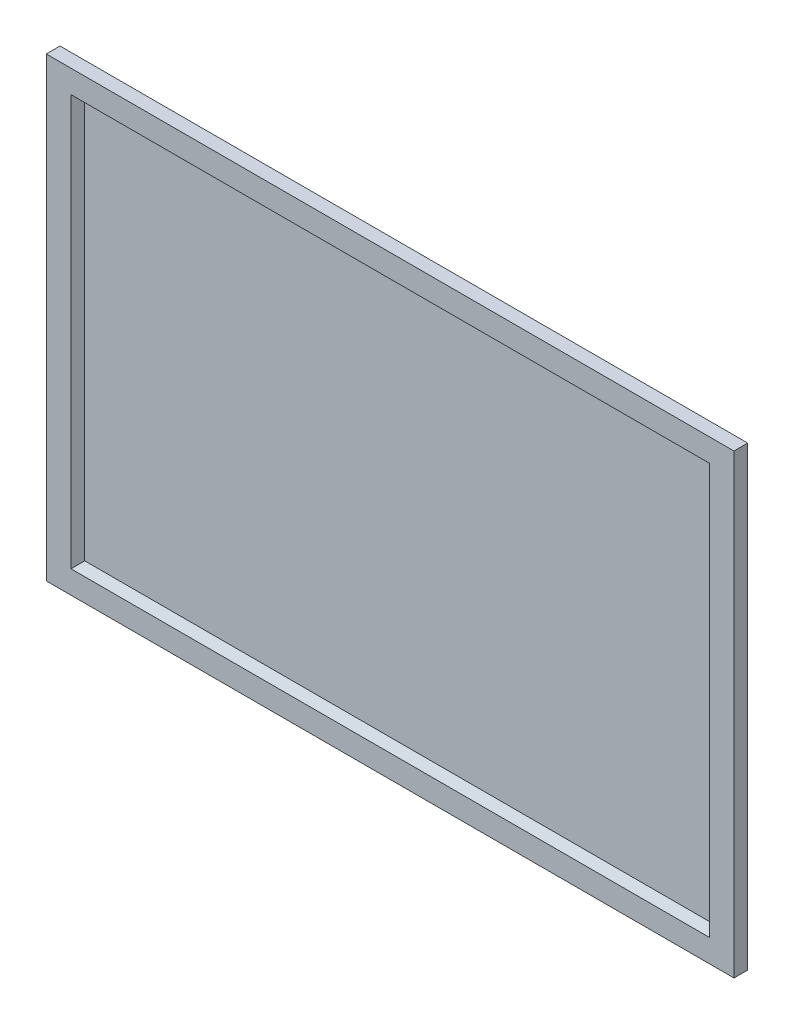
ISO-10303-21;
HEADER;
FILE_DESCRIPTION(('STEP AP214'),'2;1');
FILE_NAME('part.step','',(''),(''),'','','');
FILE_SCHEMA(('AUTOMOTIVE_DESIGN { 1 0 10303 214 1 1 1 1 }'));
ENDSEC;
DATA;
#1=APPLICATION_CONTEXT('core data for automotive mechanical design processes');
#2=APPLICATION_PROTOCOL_DEFINITION('international standard','automotive_design',2000,#1);
#3=PRODUCT_CONTEXT('',#1,'mechanical');
#4=PRODUCT('Part','Part','',(#3));
#5=PRODUCT_RELATED_PRODUCT_CATEGORY('part','',(#4));
#6=PRODUCT_DEFINITION_FORMATION('','',#4);
#7=PRODUCT_DEFINITION_CONTEXT('part definition',#1,'design');
#8=PRODUCT_DEFINITION('design','',#6,#7);
#9=PRODUCT_DEFINITION_SHAPE('','',#8);
#10=(LENGTH_UNIT() NAMED_UNIT(*) SI_UNIT(.MILLI.,.METRE.));
#11=(NAMED_UNIT(*) PLANE_ANGLE_UNIT() SI_UNIT($,.RADIAN.));
#12=(NAMED_UNIT(*) SI_UNIT($,.STERADIAN.) SOLID_ANGLE_UNIT());
#13=UNCERTAINTY_MEASURE_WITH_UNIT(LENGTH_MEASURE(1.E-05),#10,'distance_accuracy_value','');
#14=(GEOMETRIC_REPRESENTATION_CONTEXT(3) GLOBAL_UNCERTAINTY_ASSIGNED_CONTEXT((#13)) GLOBAL_UNIT_ASSIGNED_CONTEXT((#10,
#11,#12)) REPRESENTATION_CONTEXT('',''));
#15=CARTESIAN_POINT('',(0.,0.,0.));
#16=DIRECTION('',(0.,0.,1.));
#17=DIRECTION('',(1.,0.,0.));
#18=AXIS2_PLACEMENT_3D('',#15,#16,#17);
#19=CARTESIAN_POINT('',(500.,-331.818181818182,20.));
#20=DIRECTION('',(-1.,0.,0.));
#21=DIRECTION('',(0.,0.,1.));
#22=AXIS2_PLACEMENT_3D('',#19,#20,#21);
#23=PLANE('',#22);
#24=DIRECTION('',(0.,1.,0.));
#25=VECTOR('',#24,1.);
#26=CARTESIAN_POINT('',(500.,-331.818181818182,0.));
#27=LINE('',#26,#25);
#28=CARTESIAN_POINT('',(500.,-331.818181818182,0.));
#29=VERTEX_POINT('',#28);
#30=CARTESIAN_POINT('',(500.,331.818181818182,0.));
#31=VERTEX_POINT('',#30);
#32=EDGE_CURVE('E120',#29,#31,#27,.T.);
#33=ORIENTED_EDGE('',*,*,#32,.T.);
#34=DIRECTION('',(0.,0.,-1.));
#35=VECTOR('',#34,1.);
#36=CARTESIAN_POINT('',(500.,331.818181818182,20.));
#37=LINE('',#36,#35);
#38=CARTESIAN_POINT('',(500.,331.818181818182,20.));
#39=VERTEX_POINT('',#38);
#40=EDGE_CURVE('E101',#39,#31,#37,.T.);
#41=ORIENTED_EDGE('',*,*,#40,.F.);
#42=DIRECTION('',(0.,1.,0.));
#43=VECTOR('',#42,1.);
#44=CARTESIAN_POINT('',(500.,-331.818181818182,20.));
#45=LINE('',#44,#43);
#46=CARTESIAN_POINT('',(500.,-331.818181818182,20.));
#47=VERTEX_POINT('',#46);
#48=EDGE_CURVE('E108',#47,#39,#45,.T.);
#49=ORIENTED_EDGE('',*,*,#48,.F.);
#50=DIRECTION('',(0.,0.,-1.));
#51=VECTOR('',#50,1.);
#52=CARTESIAN_POINT('',(500.,-331.818181818182,20.));
#53=LINE('',#52,#51);
#54=EDGE_CURVE('E160',#47,#29,#53,.T.);
#55=ORIENTED_EDGE('',*,*,#54,.T.);
#56=EDGE_LOOP('',(#33,#41,#49,#55));
#57=FACE_BOUND('',#56,.T.);
#58=ADVANCED_FACE('F33',(#57),#23,.F.);
#59=CARTESIAN_POINT('',(-500.,331.818181818182,20.));
#60=DIRECTION('',(0.,-1.,0.));
#61=DIRECTION('',(0.,0.,-1.));
#62=AXIS2_PLACEMENT_3D('',#59,#60,#61);
#63=PLANE('',#62);
#64=DIRECTION('',(-1.,0.,0.));
#65=VECTOR('',#64,1.);
#66=CARTESIAN_POINT('',(-500.,331.818181818182,0.));
#67=LINE('',#66,#65);
#68=CARTESIAN_POINT('',(-500.,331.818181818182,0.));
#69=VERTEX_POINT('',#68);
#70=EDGE_CURVE('E151',#31,#69,#67,.T.);
#71=ORIENTED_EDGE('',*,*,#70,.T.);
#72=DIRECTION('',(0.,0.,-1.));
#73=VECTOR('',#72,1.);
#74=CARTESIAN_POINT('',(-500.,331.818181818182,20.));
#75=LINE('',#74,#73);
#76=CARTESIAN_POINT('',(-500.,331.818181818182,20.));
#77=VERTEX_POINT('',#76);
#78=EDGE_CURVE('E104',#77,#69,#75,.T.);
#79=ORIENTED_EDGE('',*,*,#78,.F.);
#80=DIRECTION('',(-1.,0.,0.));
#81=VECTOR('',#80,1.);
#82=CARTESIAN_POINT('',(-500.,331.818181818182,20.));
#83=LINE('',#82,#81);
#84=EDGE_CURVE('E97',#39,#77,#83,.T.);
#85=ORIENTED_EDGE('',*,*,#84,.F.);
#86=ORIENTED_EDGE('',*,*,#40,.T.);
#87=EDGE_LOOP('',(#71,#79,#85,#86));
#88=FACE_BOUND('',#87,.T.);
#89=ADVANCED_FACE('F99',(#88),#63,.F.);
#90=CARTESIAN_POINT('',(-500.,-331.818181818182,20.));
#91=DIRECTION('',(1.,0.,0.));
#92=DIRECTION('',(0.,0.,-1.));
#93=AXIS2_PLACEMENT_3D('',#90,#91,#92);
#94=PLANE('',#93);
#95=DIRECTION('',(0.,-1.,0.));
#96=VECTOR('',#95,1.);
#97=CARTESIAN_POINT('',(-500.,-331.818181818182,0.));
#98=LINE('',#97,#96);
#99=CARTESIAN_POINT('',(-500.,-331.818181818182,0.));
#100=VERTEX_POINT('',#99);
#101=EDGE_CURVE('E153',#69,#100,#98,.T.);
#102=ORIENTED_EDGE('',*,*,#101,.T.);
#103=DIRECTION('',(0.,0.,-1.));
#104=VECTOR('',#103,1.);
#105=CARTESIAN_POINT('',(-500.,-331.818181818182,20.));
#106=LINE('',#105,#104);
#107=CARTESIAN_POINT('',(-500.,-331.818181818182,20.));
#108=VERTEX_POINT('',#107);
#109=EDGE_CURVE('E125',#108,#100,#106,.T.);
#110=ORIENTED_EDGE('',*,*,#109,.F.);
#111=DIRECTION('',(0.,-1.,0.));
#112=VECTOR('',#111,1.);
#113=CARTESIAN_POINT('',(-500.,-331.818181818182,20.));
#114=LINE('',#113,#112);
#115=EDGE_CURVE('E107',#77,#108,#114,.T.);
#116=ORIENTED_EDGE('',*,*,#115,.F.);
#117=ORIENTED_EDGE('',*,*,#78,.T.);
#118=EDGE_LOOP('',(#102,#110,#116,#117));
#119=FACE_BOUND('',#118,.T.);
#120=ADVANCED_FACE('F170',(#119),#94,.F.);
#121=CARTESIAN_POINT('',(-500.,-331.818181818182,20.));
#122=DIRECTION('',(0.,1.,0.));
#123=DIRECTION('',(0.,0.,1.));
#124=AXIS2_PLACEMENT_3D('',#121,#122,#123);
#125=PLANE('',#124);
#126=DIRECTION('',(1.,0.,0.));
#127=VECTOR('',#126,1.);
#128=CARTESIAN_POINT('',(-500.,-331.818181818182,0.));
#129=LINE('',#128,#127);
#130=EDGE_CURVE('E117',#100,#29,#129,.T.);
#131=ORIENTED_EDGE('',*,*,#130,.T.);
#132=ORIENTED_EDGE('',*,*,#54,.F.);
#133=DIRECTION('',(1.,0.,0.));
#134=VECTOR('',#133,1.);
#135=CARTESIAN_POINT('',(-500.,-331.818181818182,20.));
#136=LINE('',#135,#134);
#137=EDGE_CURVE('E113',#108,#47,#136,.T.);
#138=ORIENTED_EDGE('',*,*,#137,.F.);
#139=ORIENTED_EDGE('',*,*,#109,.T.);
#140=EDGE_LOOP('',(#131,#132,#138,#139));
#141=FACE_BOUND('',#140,.T.);
#142=ADVANCED_FACE('F165',(#141),#125,.F.);
#143=CARTESIAN_POINT('',(0.,0.,20.));
#144=DIRECTION('',(0.,0.,-1.));
#145=DIRECTION('',(-1.,0.,0.));
#146=AXIS2_PLACEMENT_3D('',#143,#144,#145);
#147=PLANE('',#146);
#148=DIRECTION('',(-1.,0.,0.));
#149=VECTOR('',#148,1.);
#150=CARTESIAN_POINT('',(0.,298.561717833127,20.));
#151=LINE('',#150,#149);
#152=CARTESIAN_POINT('',(-464.076094370604,298.561717833127,20.));
#153=VERTEX_POINT('',#152);
#154=CARTESIAN_POINT('',(464.076094370604,298.561717833127,20.));
#155=VERTEX_POINT('',#154);
#156=EDGE_CURVE('E42',#153,#155,#151,.F.);
#157=ORIENTED_EDGE('',*,*,#156,.T.);
#158=DIRECTION('',(0.,1.,0.));
#159=VECTOR('',#158,1.);
#160=CARTESIAN_POINT('',(464.076094370604,0.,20.));
#161=LINE('',#160,#159);
#162=CARTESIAN_POINT('',(464.076094370604,-298.561717833127,20.));
#163=VERTEX_POINT('',#162);
#164=EDGE_CURVE('E11',#155,#163,#161,.F.);
#165=ORIENTED_EDGE('',*,*,#164,.T.);
#166=DIRECTION('',(1.,0.,0.));
#167=VECTOR('',#166,1.);
#168=CARTESIAN_POINT('',(0.,-298.561717833127,20.));
#169=LINE('',#168,#167);
#170=CARTESIAN_POINT('',(-464.076094370604,-298.561717833127,20.));
#171=VERTEX_POINT('',#170);
#172=EDGE_CURVE('E135',#163,#171,#169,.F.);
#173=ORIENTED_EDGE('',*,*,#172,.T.);
#174=DIRECTION('',(0.,-1.,0.));
#175=VECTOR('',#174,1.);
#176=CARTESIAN_POINT('',(-464.076094370604,0.,20.));
#177=LINE('',#176,#175);
#178=EDGE_CURVE('E53',#171,#153,#177,.F.);
#179=ORIENTED_EDGE('',*,*,#178,.T.);
#180=EDGE_LOOP('',(#157,#165,#173,#179));
#181=FACE_BOUND('',#180,.T.);
#182=ORIENTED_EDGE('',*,*,#48,.T.);
#183=ORIENTED_EDGE('',*,*,#84,.T.);
#184=ORIENTED_EDGE('',*,*,#115,.T.);
#185=ORIENTED_EDGE('',*,*,#137,.T.);
#186=EDGE_LOOP('',(#182,#183,#184,#185));
#187=FACE_BOUND('',#186,.T.);
#188=ADVANCED_FACE('F111',(#181,#187),#147,.F.);
#189=CARTESIAN_POINT('',(0.,0.,0.));
#190=DIRECTION('',(0.,0.,-1.));
#191=DIRECTION('',(-1.,0.,0.));
#192=AXIS2_PLACEMENT_3D('',#189,#190,#191);
#193=PLANE('',#192);
#194=ORIENTED_EDGE('',*,*,#32,.F.);
#195=ORIENTED_EDGE('',*,*,#130,.F.);
#196=ORIENTED_EDGE('',*,*,#101,.F.);
#197=ORIENTED_EDGE('',*,*,#70,.F.);
#198=EDGE_LOOP('',(#194,#195,#196,#197));
#199=FACE_BOUND('',#198,.T.);
#200=ADVANCED_FACE('F169',(#199),#193,.T.);
#201=CARTESIAN_POINT('',(0.,0.,10.));
#202=DIRECTION('',(0.,0.,-1.));
#203=DIRECTION('',(-1.,0.,0.));
#204=AXIS2_PLACEMENT_3D('',#201,#202,#203);
#205=PLANE('',#204);
#206=DIRECTION('',(0.,-1.,0.));
#207=VECTOR('',#206,1.);
#208=CARTESIAN_POINT('',(-454.076094370604,-308.561717833127,10.));
#209=LINE('',#208,#207);
#210=CARTESIAN_POINT('',(-454.076094370604,288.561717833127,10.));
#211=VERTEX_POINT('',#210);
#212=CARTESIAN_POINT('',(-454.076094370604,-288.561717833127,10.));
#213=VERTEX_POINT('',#212);
#214=EDGE_CURVE('E130',#211,#213,#209,.T.);
#215=ORIENTED_EDGE('',*,*,#214,.T.);
#216=DIRECTION('',(1.,0.,0.));
#217=VECTOR('',#216,1.);
#218=CARTESIAN_POINT('',(474.076094370604,-288.561717833127,10.));
#219=LINE('',#218,#217);
#220=CARTESIAN_POINT('',(454.076094370604,-288.561717833127,10.));
#221=VERTEX_POINT('',#220);
#222=EDGE_CURVE('E132',#213,#221,#219,.T.);
#223=ORIENTED_EDGE('',*,*,#222,.T.);
#224=DIRECTION('',(0.,1.,0.));
#225=VECTOR('',#224,1.);
#226=CARTESIAN_POINT('',(454.076094370604,308.561717833127,10.));
#227=LINE('',#226,#225);
#228=CARTESIAN_POINT('',(454.076094370604,288.561717833127,10.));
#229=VERTEX_POINT('',#228);
#230=EDGE_CURVE('E121',#221,#229,#227,.T.);
#231=ORIENTED_EDGE('',*,*,#230,.T.);
#232=DIRECTION('',(-1.,0.,0.));
#233=VECTOR('',#232,1.);
#234=CARTESIAN_POINT('',(-474.076094370604,288.561717833127,10.));
#235=LINE('',#234,#233);
#236=EDGE_CURVE('E123',#229,#211,#235,.T.);
#237=ORIENTED_EDGE('',*,*,#236,.T.);
#238=EDGE_LOOP('',(#215,#223,#231,#237));
#239=FACE_BOUND('',#238,.T.);
#240=ADVANCED_FACE('F195',(#239),#205,.F.);
#241=CARTESIAN_POINT('',(0.,288.561717833127,10.));
#242=DIRECTION('',(0.,-0.707106781186544,0.707106781186551));
#243=DIRECTION('',(1.,0.,0.));
#244=AXIS2_PLACEMENT_3D('',#241,#242,#243);
#245=PLANE('',#244);
#246=DIRECTION('',(-0.577350269189628,-0.577350269189628,-0.577350269189622));
#247=VECTOR('',#246,1.);
#248=CARTESIAN_POINT('',(302.717396247068,137.203019709591,-141.358698123534));
#249=LINE('',#248,#247);
#250=EDGE_CURVE('E142',#155,#229,#249,.T.);
#251=ORIENTED_EDGE('',*,*,#250,.F.);
#252=ORIENTED_EDGE('',*,*,#156,.F.);
#253=DIRECTION('',(0.577350269189628,-0.577350269189628,-0.577350269189622));
#254=VECTOR('',#253,1.);
#255=CARTESIAN_POINT('',(-357.888855092894,192.374478555417,-86.1872392777085));
#256=LINE('',#255,#254);
#257=EDGE_CURVE('E37',#211,#153,#256,.F.);
#258=ORIENTED_EDGE('',*,*,#257,.F.);
#259=ORIENTED_EDGE('',*,*,#236,.F.);
#260=EDGE_LOOP('',(#251,#252,#258,#259));
#261=FACE_BOUND('',#260,.T.);
#262=ADVANCED_FACE('F35',(#261),#245,.T.);
#263=CARTESIAN_POINT('',(-454.076094370604,0.,10.));
#264=DIRECTION('',(0.707106781186544,0.,0.707106781186551));
#265=DIRECTION('',(0.,1.,0.));
#266=AXIS2_PLACEMENT_3D('',#263,#264,#265);
#267=PLANE('',#266);
#268=ORIENTED_EDGE('',*,*,#257,.T.);
#269=ORIENTED_EDGE('',*,*,#178,.F.);
#270=DIRECTION('',(0.577350269189628,0.577350269189628,-0.577350269189622));
#271=VECTOR('',#270,1.);
#272=CARTESIAN_POINT('',(-302.717396247068,-137.203019709591,-141.358698123534));
#273=LINE('',#272,#271);
#274=EDGE_CURVE('E141',#213,#171,#273,.F.);
#275=ORIENTED_EDGE('',*,*,#274,.F.);
#276=ORIENTED_EDGE('',*,*,#214,.F.);
#277=EDGE_LOOP('',(#268,#269,#275,#276));
#278=FACE_BOUND('',#277,.T.);
#279=ADVANCED_FACE('F190',(#278),#267,.T.);
#280=CARTESIAN_POINT('',(454.076094370604,0.,10.));
#281=DIRECTION('',(-0.707106781186544,0.,0.707106781186551));
#282=DIRECTION('',(0.,-1.,0.));
#283=AXIS2_PLACEMENT_3D('',#280,#281,#282);
#284=PLANE('',#283);
#285=ORIENTED_EDGE('',*,*,#250,.T.);
#286=ORIENTED_EDGE('',*,*,#230,.F.);
#287=DIRECTION('',(0.577350269189628,-0.577350269189628,0.577350269189622));
#288=VECTOR('',#287,1.);
#289=CARTESIAN_POINT('',(302.717396247068,-137.203019709591,-141.358698123534));
#290=LINE('',#289,#288);
#291=EDGE_CURVE('E139',#163,#221,#290,.F.);
#292=ORIENTED_EDGE('',*,*,#291,.F.);
#293=ORIENTED_EDGE('',*,*,#164,.F.);
#294=EDGE_LOOP('',(#285,#286,#292,#293));
#295=FACE_BOUND('',#294,.T.);
#296=ADVANCED_FACE('F187',(#295),#284,.T.);
#297=CARTESIAN_POINT('',(0.,-288.561717833127,10.));
#298=DIRECTION('',(0.,0.707106781186544,0.707106781186551));
#299=DIRECTION('',(-1.,0.,0.));
#300=AXIS2_PLACEMENT_3D('',#297,#298,#299);
#301=PLANE('',#300);
#302=ORIENTED_EDGE('',*,*,#274,.T.);
#303=ORIENTED_EDGE('',*,*,#172,.F.);
#304=ORIENTED_EDGE('',*,*,#291,.T.);
#305=ORIENTED_EDGE('',*,*,#222,.F.);
#306=EDGE_LOOP('',(#302,#303,#304,#305));
#307=FACE_BOUND('',#306,.T.);
#308=ADVANCED_FACE('F184',(#307),#301,.T.);
#309=CLOSED_SHELL('',(#58,#89,#120,#142,#188,#200,#240,#262,#279,#296,#308));
#310=MANIFOLD_SOLID_BREP('B2',#309);
#311=ADVANCED_BREP_SHAPE_REPRESENTATION('',(#18,#310),#14);
#312=SHAPE_DEFINITION_REPRESENTATION(#9,#311);
ENDSEC;
END-ISO-10303-21;
